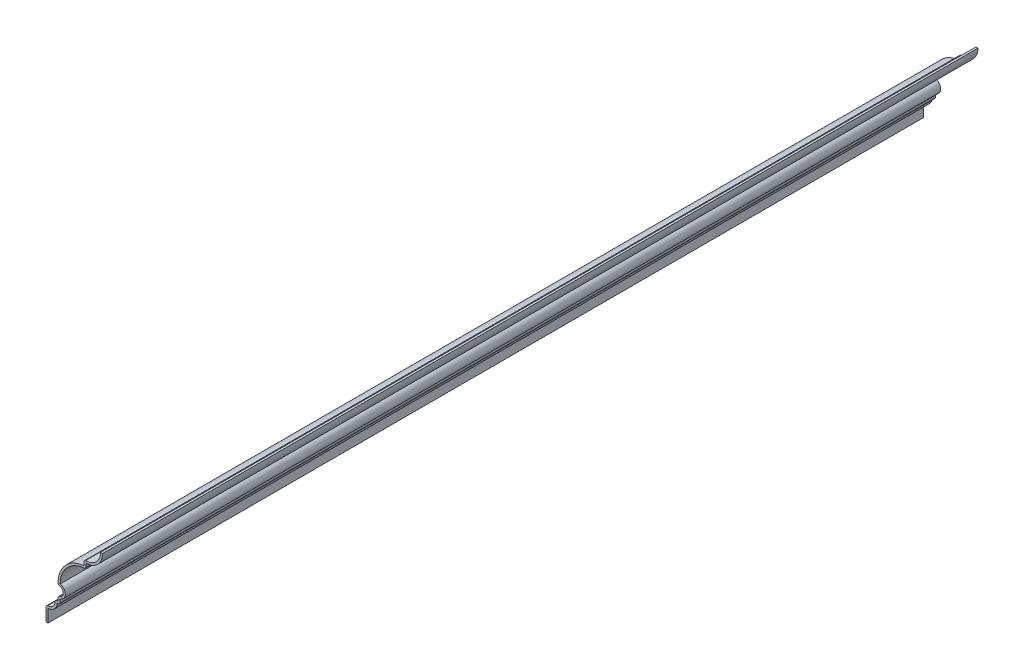
ISO-10303-21;
HEADER;
FILE_DESCRIPTION(('STEP AP214'),'2;1');
FILE_NAME('part.step','',(''),(''),'','','');
FILE_SCHEMA(('AUTOMOTIVE_DESIGN { 1 0 10303 214 1 1 1 1 }'));
ENDSEC;
DATA;
#1=APPLICATION_CONTEXT('core data for automotive mechanical design processes');
#2=APPLICATION_PROTOCOL_DEFINITION('international standard','automotive_design',2000,#1);
#3=PRODUCT_CONTEXT('',#1,'mechanical');
#4=PRODUCT('Part','Part','',(#3));
#5=PRODUCT_RELATED_PRODUCT_CATEGORY('part','',(#4));
#6=PRODUCT_DEFINITION_FORMATION('','',#4);
#7=PRODUCT_DEFINITION_CONTEXT('part definition',#1,'design');
#8=PRODUCT_DEFINITION('design','',#6,#7);
#9=PRODUCT_DEFINITION_SHAPE('','',#8);
#10=(LENGTH_UNIT() NAMED_UNIT(*) SI_UNIT(.MILLI.,.METRE.));
#11=(NAMED_UNIT(*) PLANE_ANGLE_UNIT() SI_UNIT($,.RADIAN.));
#12=(NAMED_UNIT(*) SI_UNIT($,.STERADIAN.) SOLID_ANGLE_UNIT());
#13=UNCERTAINTY_MEASURE_WITH_UNIT(LENGTH_MEASURE(1.E-05),#10,'distance_accuracy_value','');
#14=(GEOMETRIC_REPRESENTATION_CONTEXT(3) GLOBAL_UNCERTAINTY_ASSIGNED_CONTEXT((#13)) GLOBAL_UNIT_ASSIGNED_CONTEXT((#10,
#11,#12)) REPRESENTATION_CONTEXT('',''));
#15=CARTESIAN_POINT('',(0.,0.,0.));
#16=DIRECTION('',(0.,0.,1.));
#17=DIRECTION('',(1.,0.,0.));
#18=AXIS2_PLACEMENT_3D('',#15,#16,#17);
#19=CARTESIAN_POINT('',(-10.31875,53.975,-539.75));
#20=DIRECTION('',(0.,0.,1.));
#21=DIRECTION('',(1.,0.,0.));
#22=AXIS2_PLACEMENT_3D('',#19,#20,#21);
#23=CYLINDRICAL_SURFACE('',#22,10.31875);
#24=CARTESIAN_POINT('',(-10.31875,53.975,0.));
#25=DIRECTION('',(0.,0.,1.));
#26=DIRECTION('',(1.,0.,0.));
#27=AXIS2_PLACEMENT_3D('',#24,#25,#26);
#28=CIRCLE('',#27,10.31875);
#29=CARTESIAN_POINT('',(-10.31875,43.65625,0.));
#30=VERTEX_POINT('',#29);
#31=CARTESIAN_POINT('',(0.,53.975,0.));
#32=VERTEX_POINT('',#31);
#33=EDGE_CURVE('E270',#30,#32,#28,.T.);
#34=ORIENTED_EDGE('',*,*,#33,.F.);
#35=DIRECTION('',(0.,0.,1.));
#36=VECTOR('',#35,1.);
#37=CARTESIAN_POINT('',(-10.31875,43.65625,-539.75));
#38=LINE('',#37,#36);
#39=CARTESIAN_POINT('',(-10.31875,43.65625,-539.75));
#40=VERTEX_POINT('',#39);
#41=EDGE_CURVE('E226',#40,#30,#38,.T.);
#42=ORIENTED_EDGE('',*,*,#41,.F.);
#43=CARTESIAN_POINT('',(-10.31875,53.975,-539.75));
#44=DIRECTION('',(0.,0.,1.));
#45=DIRECTION('',(1.,0.,0.));
#46=AXIS2_PLACEMENT_3D('',#43,#44,#45);
#47=CIRCLE('',#46,10.31875);
#48=CARTESIAN_POINT('',(0.,53.975,-539.75));
#49=VERTEX_POINT('',#48);
#50=EDGE_CURVE('E207',#40,#49,#47,.T.);
#51=ORIENTED_EDGE('',*,*,#50,.T.);
#52=DIRECTION('',(0.,0.,1.));
#53=VECTOR('',#52,1.);
#54=CARTESIAN_POINT('',(0.,53.975,-539.75));
#55=LINE('',#54,#53);
#56=EDGE_CURVE('E214',#49,#32,#55,.T.);
#57=ORIENTED_EDGE('',*,*,#56,.T.);
#58=EDGE_LOOP('',(#34,#42,#51,#57));
#59=FACE_BOUND('',#58,.T.);
#60=ADVANCED_FACE('F35',(#59),#23,.T.);
#61=CARTESIAN_POINT('',(-10.31875,40.48125,-539.75));
#62=DIRECTION('',(1.,0.,0.));
#63=DIRECTION('',(0.,0.,-1.));
#64=AXIS2_PLACEMENT_3D('',#61,#62,#63);
#65=PLANE('',#64);
#66=DIRECTION('',(0.,1.,0.));
#67=VECTOR('',#66,1.);
#68=CARTESIAN_POINT('',(-10.31875,40.48125,0.));
#69=LINE('',#68,#67);
#70=CARTESIAN_POINT('',(-10.31875,41.704148262652,0.));
#71=VERTEX_POINT('',#70);
#72=EDGE_CURVE('E227',#71,#30,#69,.T.);
#73=ORIENTED_EDGE('',*,*,#72,.F.);
#74=DIRECTION('',(0.,0.,1.));
#75=VECTOR('',#74,1.);
#76=CARTESIAN_POINT('',(-10.31875,41.704148262652,-539.75));
#77=LINE('',#76,#75);
#78=CARTESIAN_POINT('',(-10.31875,41.704148262652,-539.75));
#79=VERTEX_POINT('',#78);
#80=EDGE_CURVE('E388',#71,#79,#77,.F.);
#81=ORIENTED_EDGE('',*,*,#80,.T.);
#82=DIRECTION('',(0.,1.,0.));
#83=VECTOR('',#82,1.);
#84=CARTESIAN_POINT('',(-10.31875,40.48125,-539.75));
#85=LINE('',#84,#83);
#86=EDGE_CURVE('E222',#79,#40,#85,.T.);
#87=ORIENTED_EDGE('',*,*,#86,.T.);
#88=ORIENTED_EDGE('',*,*,#41,.T.);
#89=EDGE_LOOP('',(#73,#81,#87,#88));
#90=FACE_BOUND('',#89,.T.);
#91=ADVANCED_FACE('F402',(#90),#65,.T.);
#92=CARTESIAN_POINT('',(-10.31875,24.60625,-539.75));
#93=DIRECTION('',(0.,0.,1.));
#94=DIRECTION('',(1.,0.,0.));
#95=AXIS2_PLACEMENT_3D('',#92,#93,#94);
#96=CYLINDRICAL_SURFACE('',#95,15.875);
#97=CARTESIAN_POINT('',(-10.31875,24.60625,-539.75));
#98=DIRECTION('',(0.,0.,-1.));
#99=DIRECTION('',(-1.,0.,0.));
#100=AXIS2_PLACEMENT_3D('',#97,#98,#99);
#101=CIRCLE('',#100,15.875);
#102=CARTESIAN_POINT('',(-26.19375,24.60625,-539.75));
#103=VERTEX_POINT('',#102);
#104=CARTESIAN_POINT('',(-11.4946759259259,40.4376372802334,-539.75));
#105=VERTEX_POINT('',#104);
#106=EDGE_CURVE('E266',#103,#105,#101,.T.);
#107=ORIENTED_EDGE('',*,*,#106,.T.);
#108=DIRECTION('',(0.,0.,1.));
#109=VECTOR('',#108,1.);
#110=CARTESIAN_POINT('',(-11.4946759259259,40.4376372802334,-539.75));
#111=LINE('',#110,#109);
#112=CARTESIAN_POINT('',(-11.4946759259259,40.4376372802334,0.));
#113=VERTEX_POINT('',#112);
#114=EDGE_CURVE('E385',#105,#113,#111,.T.);
#115=ORIENTED_EDGE('',*,*,#114,.T.);
#116=CARTESIAN_POINT('',(-10.31875,24.60625,0.));
#117=DIRECTION('',(0.,0.,-1.));
#118=DIRECTION('',(-1.,0.,0.));
#119=AXIS2_PLACEMENT_3D('',#116,#117,#118);
#120=CIRCLE('',#119,15.875);
#121=CARTESIAN_POINT('',(-26.19375,24.60625,0.));
#122=VERTEX_POINT('',#121);
#123=EDGE_CURVE('E229',#122,#113,#120,.T.);
#124=ORIENTED_EDGE('',*,*,#123,.F.);
#125=DIRECTION('',(0.,0.,1.));
#126=VECTOR('',#125,1.);
#127=CARTESIAN_POINT('',(-26.19375,24.60625,-539.75));
#128=LINE('',#127,#126);
#129=EDGE_CURVE('E313',#103,#122,#128,.T.);
#130=ORIENTED_EDGE('',*,*,#129,.F.);
#131=EDGE_LOOP('',(#107,#115,#124,#130));
#132=FACE_BOUND('',#131,.T.);
#133=ADVANCED_FACE('F410',(#132),#96,.F.);
#134=CARTESIAN_POINT('',(-27.08671875,20.6375,-539.75));
#135=DIRECTION('',(0.,0.,1.));
#136=DIRECTION('',(1.,0.,0.));
#137=AXIS2_PLACEMENT_3D('',#134,#135,#136);
#138=CYLINDRICAL_SURFACE('',#137,4.06796875);
#139=CARTESIAN_POINT('',(-27.08671875,20.6375,0.));
#140=DIRECTION('',(0.,0.,1.));
#141=DIRECTION('',(1.,0.,0.));
#142=AXIS2_PLACEMENT_3D('',#139,#140,#141);
#143=CIRCLE('',#142,4.06796875);
#144=CARTESIAN_POINT('',(-26.19375,16.66875,0.));
#145=VERTEX_POINT('',#144);
#146=EDGE_CURVE('E306',#145,#122,#143,.T.);
#147=ORIENTED_EDGE('',*,*,#146,.F.);
#148=DIRECTION('',(0.,0.,1.));
#149=VECTOR('',#148,1.);
#150=CARTESIAN_POINT('',(-26.19375,16.66875,-539.75));
#151=LINE('',#150,#149);
#152=CARTESIAN_POINT('',(-26.19375,16.66875,-539.75));
#153=VERTEX_POINT('',#152);
#154=EDGE_CURVE('E315',#153,#145,#151,.T.);
#155=ORIENTED_EDGE('',*,*,#154,.F.);
#156=CARTESIAN_POINT('',(-27.08671875,20.6375,-539.75));
#157=DIRECTION('',(0.,0.,1.));
#158=DIRECTION('',(1.,0.,0.));
#159=AXIS2_PLACEMENT_3D('',#156,#157,#158);
#160=CIRCLE('',#159,4.06796875);
#161=EDGE_CURVE('E263',#153,#103,#160,.T.);
#162=ORIENTED_EDGE('',*,*,#161,.T.);
#163=ORIENTED_EDGE('',*,*,#129,.T.);
#164=EDGE_LOOP('',(#147,#155,#162,#163));
#165=FACE_BOUND('',#164,.T.);
#166=ADVANCED_FACE('F415',(#165),#138,.T.);
#167=CARTESIAN_POINT('',(-26.19375,13.49375,-539.75));
#168=DIRECTION('',(1.,0.,0.));
#169=DIRECTION('',(0.,0.,-1.));
#170=AXIS2_PLACEMENT_3D('',#167,#168,#169);
#171=PLANE('',#170);
#172=DIRECTION('',(0.,1.,0.));
#173=VECTOR('',#172,1.);
#174=CARTESIAN_POINT('',(-26.19375,13.49375,0.));
#175=LINE('',#174,#173);
#176=CARTESIAN_POINT('',(-26.19375,14.76375,0.));
#177=VERTEX_POINT('',#176);
#178=EDGE_CURVE('E304',#177,#145,#175,.T.);
#179=ORIENTED_EDGE('',*,*,#178,.F.);
#180=DIRECTION('',(0.,0.,1.));
#181=VECTOR('',#180,1.);
#182=CARTESIAN_POINT('',(-26.19375,14.76375,-539.75));
#183=LINE('',#182,#181);
#184=CARTESIAN_POINT('',(-26.19375,14.76375,-539.75));
#185=VERTEX_POINT('',#184);
#186=EDGE_CURVE('E373',#177,#185,#183,.F.);
#187=ORIENTED_EDGE('',*,*,#186,.T.);
#188=DIRECTION('',(0.,1.,0.));
#189=VECTOR('',#188,1.);
#190=CARTESIAN_POINT('',(-26.19375,13.49375,-539.75));
#191=LINE('',#190,#189);
#192=EDGE_CURVE('E261',#185,#153,#191,.T.);
#193=ORIENTED_EDGE('',*,*,#192,.T.);
#194=ORIENTED_EDGE('',*,*,#154,.T.);
#195=EDGE_LOOP('',(#179,#187,#193,#194));
#196=FACE_BOUND('',#195,.T.);
#197=ADVANCED_FACE('F651',(#196),#171,.T.);
#198=CARTESIAN_POINT('',(-28.09875,13.49375,-539.75));
#199=DIRECTION('',(0.,-1.,0.));
#200=DIRECTION('',(0.,0.,-1.));
#201=AXIS2_PLACEMENT_3D('',#198,#199,#200);
#202=PLANE('',#201);
#203=DIRECTION('',(1.,0.,0.));
#204=VECTOR('',#203,1.);
#205=CARTESIAN_POINT('',(-28.09875,13.49375,-539.75));
#206=LINE('',#205,#204);
#207=CARTESIAN_POINT('',(-28.09875,13.49375,-539.75));
#208=VERTEX_POINT('',#207);
#209=CARTESIAN_POINT('',(-27.46375,13.49375,-539.75));
#210=VERTEX_POINT('',#209);
#211=EDGE_CURVE('E258',#208,#210,#206,.T.);
#212=ORIENTED_EDGE('',*,*,#211,.T.);
#213=DIRECTION('',(0.,0.,1.));
#214=VECTOR('',#213,1.);
#215=CARTESIAN_POINT('',(-27.46375,13.49375,-539.75));
#216=LINE('',#215,#214);
#217=CARTESIAN_POINT('',(-27.46375,13.49375,0.));
#218=VERTEX_POINT('',#217);
#219=EDGE_CURVE('E370',#210,#218,#216,.T.);
#220=ORIENTED_EDGE('',*,*,#219,.T.);
#221=DIRECTION('',(1.,0.,0.));
#222=VECTOR('',#221,1.);
#223=CARTESIAN_POINT('',(-28.09875,13.49375,0.));
#224=LINE('',#223,#222);
#225=CARTESIAN_POINT('',(-28.09875,13.49375,0.));
#226=VERTEX_POINT('',#225);
#227=EDGE_CURVE('E301',#226,#218,#224,.T.);
#228=ORIENTED_EDGE('',*,*,#227,.F.);
#229=DIRECTION('',(0.,0.,1.));
#230=VECTOR('',#229,1.);
#231=CARTESIAN_POINT('',(-28.09875,13.49375,-539.75));
#232=LINE('',#231,#230);
#233=EDGE_CURVE('E318',#208,#226,#232,.T.);
#234=ORIENTED_EDGE('',*,*,#233,.F.);
#235=EDGE_LOOP('',(#212,#220,#228,#234));
#236=FACE_BOUND('',#235,.T.);
#237=ADVANCED_FACE('F427',(#236),#202,.T.);
#238=CARTESIAN_POINT('',(-33.655,13.49375,-539.75));
#239=DIRECTION('',(0.,0.,1.));
#240=DIRECTION('',(1.,0.,0.));
#241=AXIS2_PLACEMENT_3D('',#238,#239,#240);
#242=CYLINDRICAL_SURFACE('',#241,5.55625);
#243=CARTESIAN_POINT('',(-33.655,13.49375,0.));
#244=DIRECTION('',(0.,0.,1.));
#245=DIRECTION('',(1.,0.,0.));
#246=AXIS2_PLACEMENT_3D('',#243,#244,#245);
#247=CIRCLE('',#246,5.55625);
#248=CARTESIAN_POINT('',(-33.655,7.9375,0.));
#249=VERTEX_POINT('',#248);
#250=EDGE_CURVE('E298',#249,#226,#247,.T.);
#251=ORIENTED_EDGE('',*,*,#250,.F.);
#252=DIRECTION('',(0.,0.,1.));
#253=VECTOR('',#252,1.);
#254=CARTESIAN_POINT('',(-33.655,7.9375,-539.75));
#255=LINE('',#254,#253);
#256=CARTESIAN_POINT('',(-33.655,7.9375,-539.75));
#257=VERTEX_POINT('',#256);
#258=EDGE_CURVE('E320',#257,#249,#255,.T.);
#259=ORIENTED_EDGE('',*,*,#258,.F.);
#260=CARTESIAN_POINT('',(-33.655,13.49375,-539.75));
#261=DIRECTION('',(0.,0.,1.));
#262=DIRECTION('',(1.,0.,0.));
#263=AXIS2_PLACEMENT_3D('',#260,#261,#262);
#264=CIRCLE('',#263,5.55625);
#265=EDGE_CURVE('E255',#257,#208,#264,.T.);
#266=ORIENTED_EDGE('',*,*,#265,.T.);
#267=ORIENTED_EDGE('',*,*,#233,.T.);
#268=EDGE_LOOP('',(#251,#259,#266,#267));
#269=FACE_BOUND('',#268,.T.);
#270=ADVANCED_FACE('F432',(#269),#242,.T.);
#271=CARTESIAN_POINT('',(-33.655,0.,-539.75));
#272=DIRECTION('',(1.,0.,0.));
#273=DIRECTION('',(0.,0.,-1.));
#274=AXIS2_PLACEMENT_3D('',#271,#272,#273);
#275=PLANE('',#274);
#276=DIRECTION('',(0.,1.,0.));
#277=VECTOR('',#276,1.);
#278=CARTESIAN_POINT('',(-33.655,0.,0.));
#279=LINE('',#278,#277);
#280=CARTESIAN_POINT('',(-33.655,0.,0.));
#281=VERTEX_POINT('',#280);
#282=EDGE_CURVE('E295',#281,#249,#279,.T.);
#283=ORIENTED_EDGE('',*,*,#282,.F.);
#284=DIRECTION('',(0.,0.,1.));
#285=VECTOR('',#284,1.);
#286=CARTESIAN_POINT('',(-33.655,0.,-539.75));
#287=LINE('',#286,#285);
#288=CARTESIAN_POINT('',(-33.655,0.,-539.75));
#289=VERTEX_POINT('',#288);
#290=EDGE_CURVE('E322',#289,#281,#287,.T.);
#291=ORIENTED_EDGE('',*,*,#290,.F.);
#292=DIRECTION('',(0.,1.,0.));
#293=VECTOR('',#292,1.);
#294=CARTESIAN_POINT('',(-33.655,0.,-539.75));
#295=LINE('',#294,#293);
#296=EDGE_CURVE('E252',#289,#257,#295,.T.);
#297=ORIENTED_EDGE('',*,*,#296,.T.);
#298=ORIENTED_EDGE('',*,*,#258,.T.);
#299=EDGE_LOOP('',(#283,#291,#297,#298));
#300=FACE_BOUND('',#299,.T.);
#301=ADVANCED_FACE('F436',(#300),#275,.T.);
#302=CARTESIAN_POINT('',(-33.655,0.,-539.75));
#303=DIRECTION('',(0.,1.,0.));
#304=DIRECTION('',(0.,0.,1.));
#305=AXIS2_PLACEMENT_3D('',#302,#303,#304);
#306=PLANE('',#305);
#307=DIRECTION('',(-1.,0.,0.));
#308=VECTOR('',#307,1.);
#309=CARTESIAN_POINT('',(-33.655,0.,0.));
#310=LINE('',#309,#308);
#311=CARTESIAN_POINT('',(-34.925,0.,0.));
#312=VERTEX_POINT('',#311);
#313=EDGE_CURVE('E293',#281,#312,#310,.T.);
#314=ORIENTED_EDGE('',*,*,#313,.T.);
#315=DIRECTION('',(0.,0.,1.));
#316=VECTOR('',#315,1.);
#317=CARTESIAN_POINT('',(-34.925,0.,-539.75));
#318=LINE('',#317,#316);
#319=CARTESIAN_POINT('',(-34.925,0.,-539.75));
#320=VERTEX_POINT('',#319);
#321=EDGE_CURVE('E324',#320,#312,#318,.T.);
#322=ORIENTED_EDGE('',*,*,#321,.F.);
#323=DIRECTION('',(-1.,0.,0.));
#324=VECTOR('',#323,1.);
#325=CARTESIAN_POINT('',(-33.655,0.,-539.75));
#326=LINE('',#325,#324);
#327=EDGE_CURVE('E250',#289,#320,#326,.T.);
#328=ORIENTED_EDGE('',*,*,#327,.F.);
#329=ORIENTED_EDGE('',*,*,#290,.T.);
#330=EDGE_LOOP('',(#314,#322,#328,#329));
#331=FACE_BOUND('',#330,.T.);
#332=ADVANCED_FACE('F440',(#331),#306,.F.);
#333=CARTESIAN_POINT('',(-34.925,0.,-539.75));
#334=DIRECTION('',(1.,0.,0.));
#335=DIRECTION('',(0.,0.,-1.));
#336=AXIS2_PLACEMENT_3D('',#333,#334,#335);
#337=PLANE('',#336);
#338=DIRECTION('',(0.,1.,0.));
#339=VECTOR('',#338,1.);
#340=CARTESIAN_POINT('',(-34.925,0.,0.));
#341=LINE('',#340,#339);
#342=CARTESIAN_POINT('',(-34.925,7.9375,0.));
#343=VERTEX_POINT('',#342);
#344=EDGE_CURVE('E290',#312,#343,#341,.T.);
#345=ORIENTED_EDGE('',*,*,#344,.T.);
#346=DIRECTION('',(0.,0.,1.));
#347=VECTOR('',#346,1.);
#348=CARTESIAN_POINT('',(-34.925,7.9375,-539.75));
#349=LINE('',#348,#347);
#350=CARTESIAN_POINT('',(-34.925,7.9375,-539.75));
#351=VERTEX_POINT('',#350);
#352=EDGE_CURVE('E352',#343,#351,#349,.F.);
#353=ORIENTED_EDGE('',*,*,#352,.T.);
#354=DIRECTION('',(0.,1.,0.));
#355=VECTOR('',#354,1.);
#356=CARTESIAN_POINT('',(-34.925,0.,-539.75));
#357=LINE('',#356,#355);
#358=EDGE_CURVE('E248',#320,#351,#357,.T.);
#359=ORIENTED_EDGE('',*,*,#358,.F.);
#360=ORIENTED_EDGE('',*,*,#321,.T.);
#361=EDGE_LOOP('',(#345,#353,#359,#360));
#362=FACE_BOUND('',#361,.T.);
#363=ADVANCED_FACE('F615',(#362),#337,.F.);
#364=CARTESIAN_POINT('',(-33.655,13.49375,-539.75));
#365=DIRECTION('',(0.,0.,1.));
#366=DIRECTION('',(1.,0.,0.));
#367=AXIS2_PLACEMENT_3D('',#364,#365,#366);
#368=CYLINDRICAL_SURFACE('',#367,4.28625);
#369=CARTESIAN_POINT('',(-33.655,13.49375,-539.75));
#370=DIRECTION('',(0.,0.,1.));
#371=DIRECTION('',(1.,0.,0.));
#372=AXIS2_PLACEMENT_3D('',#369,#370,#371);
#373=CIRCLE('',#372,4.28625);
#374=CARTESIAN_POINT('',(-33.655,9.2075,-539.75));
#375=VERTEX_POINT('',#374);
#376=CARTESIAN_POINT('',(-29.36875,13.49375,-539.75));
#377=VERTEX_POINT('',#376);
#378=EDGE_CURVE('E245',#375,#377,#373,.T.);
#379=ORIENTED_EDGE('',*,*,#378,.F.);
#380=DIRECTION('',(0.,0.,1.));
#381=VECTOR('',#380,1.);
#382=CARTESIAN_POINT('',(-33.655,9.2075,-539.75));
#383=LINE('',#382,#381);
#384=CARTESIAN_POINT('',(-33.655,9.2075,0.));
#385=VERTEX_POINT('',#384);
#386=EDGE_CURVE('E335',#375,#385,#383,.T.);
#387=ORIENTED_EDGE('',*,*,#386,.T.);
#388=CARTESIAN_POINT('',(-33.655,13.49375,0.));
#389=DIRECTION('',(0.,0.,1.));
#390=DIRECTION('',(1.,0.,0.));
#391=AXIS2_PLACEMENT_3D('',#388,#389,#390);
#392=CIRCLE('',#391,4.28625);
#393=CARTESIAN_POINT('',(-29.36875,13.49375,0.));
#394=VERTEX_POINT('',#393);
#395=EDGE_CURVE('E287',#385,#394,#392,.T.);
#396=ORIENTED_EDGE('',*,*,#395,.T.);
#397=DIRECTION('',(0.,0.,1.));
#398=VECTOR('',#397,1.);
#399=CARTESIAN_POINT('',(-29.36875,13.49375,-539.75));
#400=LINE('',#399,#398);
#401=EDGE_CURVE('E312',#394,#377,#400,.F.);
#402=ORIENTED_EDGE('',*,*,#401,.T.);
#403=EDGE_LOOP('',(#379,#387,#396,#402));
#404=FACE_BOUND('',#403,.T.);
#405=ADVANCED_FACE('F450',(#404),#368,.F.);
#406=CARTESIAN_POINT('',(-28.09875,14.76375,-539.75));
#407=DIRECTION('',(0.,-1.,0.));
#408=DIRECTION('',(0.,0.,-1.));
#409=AXIS2_PLACEMENT_3D('',#406,#407,#408);
#410=PLANE('',#409);
#411=DIRECTION('',(1.,0.,0.));
#412=VECTOR('',#411,1.);
#413=CARTESIAN_POINT('',(-28.09875,14.76375,-539.75));
#414=LINE('',#413,#412);
#415=CARTESIAN_POINT('',(-28.09875,14.76375,-539.75));
#416=VERTEX_POINT('',#415);
#417=CARTESIAN_POINT('',(-27.46375,14.76375,-539.75));
#418=VERTEX_POINT('',#417);
#419=EDGE_CURVE('E243',#416,#418,#414,.T.);
#420=ORIENTED_EDGE('',*,*,#419,.F.);
#421=DIRECTION('',(0.,0.,1.));
#422=VECTOR('',#421,1.);
#423=CARTESIAN_POINT('',(-28.09875,14.76375,-539.75));
#424=LINE('',#423,#422);
#425=CARTESIAN_POINT('',(-28.09875,14.76375,0.));
#426=VERTEX_POINT('',#425);
#427=EDGE_CURVE('E367',#416,#426,#424,.T.);
#428=ORIENTED_EDGE('',*,*,#427,.T.);
#429=DIRECTION('',(1.,0.,0.));
#430=VECTOR('',#429,1.);
#431=CARTESIAN_POINT('',(-28.09875,14.76375,0.));
#432=LINE('',#431,#430);
#433=CARTESIAN_POINT('',(-27.46375,14.76375,0.));
#434=VERTEX_POINT('',#433);
#435=EDGE_CURVE('E285',#426,#434,#432,.T.);
#436=ORIENTED_EDGE('',*,*,#435,.T.);
#437=DIRECTION('',(0.,0.,1.));
#438=VECTOR('',#437,1.);
#439=CARTESIAN_POINT('',(-27.46375,14.76375,-539.75));
#440=LINE('',#439,#438);
#441=EDGE_CURVE('E327',#418,#434,#440,.T.);
#442=ORIENTED_EDGE('',*,*,#441,.F.);
#443=EDGE_LOOP('',(#420,#428,#436,#442));
#444=FACE_BOUND('',#443,.T.);
#445=ADVANCED_FACE('F461',(#444),#410,.F.);
#446=CARTESIAN_POINT('',(-27.46375,13.49375,-539.75));
#447=DIRECTION('',(1.,0.,0.));
#448=DIRECTION('',(0.,0.,-1.));
#449=AXIS2_PLACEMENT_3D('',#446,#447,#448);
#450=PLANE('',#449);
#451=DIRECTION('',(0.,1.,0.));
#452=VECTOR('',#451,1.);
#453=CARTESIAN_POINT('',(-27.46375,13.49375,0.));
#454=LINE('',#453,#452);
#455=CARTESIAN_POINT('',(-27.46375,16.66875,0.));
#456=VERTEX_POINT('',#455);
#457=EDGE_CURVE('E282',#434,#456,#454,.T.);
#458=ORIENTED_EDGE('',*,*,#457,.T.);
#459=DIRECTION('',(0.,0.,1.));
#460=VECTOR('',#459,1.);
#461=CARTESIAN_POINT('',(-27.46375,16.66875,-539.75));
#462=LINE('',#461,#460);
#463=CARTESIAN_POINT('',(-27.46375,16.66875,-539.75));
#464=VERTEX_POINT('',#463);
#465=EDGE_CURVE('E380',#456,#464,#462,.F.);
#466=ORIENTED_EDGE('',*,*,#465,.T.);
#467=DIRECTION('',(0.,1.,0.));
#468=VECTOR('',#467,1.);
#469=CARTESIAN_POINT('',(-27.46375,13.49375,-539.75));
#470=LINE('',#469,#468);
#471=EDGE_CURVE('E240',#418,#464,#470,.T.);
#472=ORIENTED_EDGE('',*,*,#471,.F.);
#473=ORIENTED_EDGE('',*,*,#441,.T.);
#474=EDGE_LOOP('',(#458,#466,#472,#473));
#475=FACE_BOUND('',#474,.T.);
#476=ADVANCED_FACE('F593',(#475),#450,.F.);
#477=CARTESIAN_POINT('',(-27.08671875,20.6375,-539.75));
#478=DIRECTION('',(0.,0.,1.));
#479=DIRECTION('',(1.,0.,0.));
#480=AXIS2_PLACEMENT_3D('',#477,#478,#479);
#481=CYLINDRICAL_SURFACE('',#480,2.79796875);
#482=CARTESIAN_POINT('',(-27.08671875,20.6375,-539.75));
#483=DIRECTION('',(0.,0.,1.));
#484=DIRECTION('',(1.,0.,0.));
#485=AXIS2_PLACEMENT_3D('',#482,#483,#484);
#486=CIRCLE('',#485,2.79796875);
#487=CARTESIAN_POINT('',(-26.4725304878049,17.9077743902439,-539.75));
#488=VERTEX_POINT('',#487);
#489=CARTESIAN_POINT('',(-26.4725304878049,23.3672256097561,-539.75));
#490=VERTEX_POINT('',#489);
#491=EDGE_CURVE('E237',#488,#490,#486,.T.);
#492=ORIENTED_EDGE('',*,*,#491,.F.);
#493=DIRECTION('',(0.,0.,1.));
#494=VECTOR('',#493,1.);
#495=CARTESIAN_POINT('',(-26.4725304878049,17.9077743902439,-539.75));
#496=LINE('',#495,#494);
#497=CARTESIAN_POINT('',(-26.4725304878049,17.9077743902439,0.));
#498=VERTEX_POINT('',#497);
#499=EDGE_CURVE('E377',#488,#498,#496,.T.);
#500=ORIENTED_EDGE('',*,*,#499,.T.);
#501=CARTESIAN_POINT('',(-27.08671875,20.6375,0.));
#502=DIRECTION('',(0.,0.,1.));
#503=DIRECTION('',(1.,0.,0.));
#504=AXIS2_PLACEMENT_3D('',#501,#502,#503);
#505=CIRCLE('',#504,2.79796875);
#506=CARTESIAN_POINT('',(-26.4725304878049,23.3672256097561,0.));
#507=VERTEX_POINT('',#506);
#508=EDGE_CURVE('E279',#498,#507,#505,.T.);
#509=ORIENTED_EDGE('',*,*,#508,.T.);
#510=DIRECTION('',(0.,0.,1.));
#511=VECTOR('',#510,1.);
#512=CARTESIAN_POINT('',(-26.4725304878049,23.3672256097561,-539.75));
#513=LINE('',#512,#511);
#514=EDGE_CURVE('E375',#507,#490,#513,.F.);
#515=ORIENTED_EDGE('',*,*,#514,.T.);
#516=EDGE_LOOP('',(#492,#500,#509,#515));
#517=FACE_BOUND('',#516,.T.);
#518=ADVANCED_FACE('F473',(#517),#481,.F.);
#519=CARTESIAN_POINT('',(-10.31875,24.60625,-539.75));
#520=DIRECTION('',(0.,0.,1.));
#521=DIRECTION('',(1.,0.,0.));
#522=AXIS2_PLACEMENT_3D('',#519,#520,#521);
#523=CYLINDRICAL_SURFACE('',#522,17.145);
#524=CARTESIAN_POINT('',(-10.31875,24.60625,-539.75));
#525=DIRECTION('',(0.,0.,1.));
#526=DIRECTION('',(1.,0.,0.));
#527=AXIS2_PLACEMENT_3D('',#524,#525,#526);
#528=CIRCLE('',#527,17.145);
#529=CARTESIAN_POINT('',(-27.46375,24.60625,-539.75));
#530=VERTEX_POINT('',#529);
#531=CARTESIAN_POINT('',(-11.58875,41.704148262652,-539.75));
#532=VERTEX_POINT('',#531);
#533=EDGE_CURVE('E235',#530,#532,#528,.F.);
#534=ORIENTED_EDGE('',*,*,#533,.F.);
#535=DIRECTION('',(0.,0.,1.));
#536=VECTOR('',#535,1.);
#537=CARTESIAN_POINT('',(-27.46375,24.60625,-539.75));
#538=LINE('',#537,#536);
#539=CARTESIAN_POINT('',(-27.46375,24.60625,0.));
#540=VERTEX_POINT('',#539);
#541=EDGE_CURVE('E382',#530,#540,#538,.T.);
#542=ORIENTED_EDGE('',*,*,#541,.T.);
#543=CARTESIAN_POINT('',(-10.31875,24.60625,0.));
#544=DIRECTION('',(0.,0.,1.));
#545=DIRECTION('',(1.,0.,0.));
#546=AXIS2_PLACEMENT_3D('',#543,#544,#545);
#547=CIRCLE('',#546,17.145);
#548=CARTESIAN_POINT('',(-11.58875,41.704148262652,0.));
#549=VERTEX_POINT('',#548);
#550=EDGE_CURVE('E277',#540,#549,#547,.F.);
#551=ORIENTED_EDGE('',*,*,#550,.T.);
#552=DIRECTION('',(0.,0.,1.));
#553=VECTOR('',#552,1.);
#554=CARTESIAN_POINT('',(-11.58875,41.704148262652,-539.75));
#555=LINE('',#554,#553);
#556=EDGE_CURVE('E330',#532,#549,#555,.T.);
#557=ORIENTED_EDGE('',*,*,#556,.F.);
#558=EDGE_LOOP('',(#534,#542,#551,#557));
#559=FACE_BOUND('',#558,.T.);
#560=ADVANCED_FACE('F482',(#559),#523,.T.);
#561=CARTESIAN_POINT('',(-11.58875,40.48125,-539.75));
#562=DIRECTION('',(1.,0.,0.));
#563=DIRECTION('',(0.,0.,-1.));
#564=AXIS2_PLACEMENT_3D('',#561,#562,#563);
#565=PLANE('',#564);
#566=DIRECTION('',(0.,1.,0.));
#567=VECTOR('',#566,1.);
#568=CARTESIAN_POINT('',(-11.58875,40.48125,0.));
#569=LINE('',#568,#567);
#570=CARTESIAN_POINT('',(-11.58875,43.65625,0.));
#571=VERTEX_POINT('',#570);
#572=EDGE_CURVE('E275',#549,#571,#569,.T.);
#573=ORIENTED_EDGE('',*,*,#572,.T.);
#574=DIRECTION('',(0.,0.,1.));
#575=VECTOR('',#574,1.);
#576=CARTESIAN_POINT('',(-11.58875,43.65625,-539.75));
#577=LINE('',#576,#575);
#578=CARTESIAN_POINT('',(-11.58875,43.65625,-539.75));
#579=VERTEX_POINT('',#578);
#580=EDGE_CURVE('E11',#571,#579,#577,.F.);
#581=ORIENTED_EDGE('',*,*,#580,.T.);
#582=DIRECTION('',(0.,1.,0.));
#583=VECTOR('',#582,1.);
#584=CARTESIAN_POINT('',(-11.58875,40.48125,-539.75));
#585=LINE('',#584,#583);
#586=EDGE_CURVE('E233',#532,#579,#585,.T.);
#587=ORIENTED_EDGE('',*,*,#586,.F.);
#588=ORIENTED_EDGE('',*,*,#556,.T.);
#589=EDGE_LOOP('',(#573,#581,#587,#588));
#590=FACE_BOUND('',#589,.T.);
#591=ADVANCED_FACE('F572',(#590),#565,.F.);
#592=CARTESIAN_POINT('',(-10.31875,53.975,-539.75));
#593=DIRECTION('',(0.,0.,1.));
#594=DIRECTION('',(1.,0.,0.));
#595=AXIS2_PLACEMENT_3D('',#592,#593,#594);
#596=CYLINDRICAL_SURFACE('',#595,9.04875);
#597=CARTESIAN_POINT('',(-10.31875,53.975,-539.75));
#598=DIRECTION('',(0.,0.,1.));
#599=DIRECTION('',(1.,0.,0.));
#600=AXIS2_PLACEMENT_3D('',#597,#598,#599);
#601=CIRCLE('',#600,9.04875);
#602=CARTESIAN_POINT('',(-10.31875,44.92625,-539.75));
#603=VERTEX_POINT('',#602);
#604=CARTESIAN_POINT('',(-1.27,53.975,-539.75));
#605=VERTEX_POINT('',#604);
#606=EDGE_CURVE('E208',#603,#605,#601,.T.);
#607=ORIENTED_EDGE('',*,*,#606,.F.);
#608=DIRECTION('',(0.,0.,1.));
#609=VECTOR('',#608,1.);
#610=CARTESIAN_POINT('',(-10.31875,44.92625,-539.75));
#611=LINE('',#610,#609);
#612=CARTESIAN_POINT('',(-10.31875,44.92625,0.));
#613=VERTEX_POINT('',#612);
#614=EDGE_CURVE('E43',#603,#613,#611,.T.);
#615=ORIENTED_EDGE('',*,*,#614,.T.);
#616=CARTESIAN_POINT('',(-10.31875,53.975,0.));
#617=DIRECTION('',(0.,0.,1.));
#618=DIRECTION('',(1.,0.,0.));
#619=AXIS2_PLACEMENT_3D('',#616,#617,#618);
#620=CIRCLE('',#619,9.04875);
#621=CARTESIAN_POINT('',(-1.27,53.975,0.));
#622=VERTEX_POINT('',#621);
#623=EDGE_CURVE('E273',#613,#622,#620,.T.);
#624=ORIENTED_EDGE('',*,*,#623,.T.);
#625=DIRECTION('',(0.,0.,1.));
#626=VECTOR('',#625,1.);
#627=CARTESIAN_POINT('',(-1.27,53.975,-539.75));
#628=LINE('',#627,#626);
#629=EDGE_CURVE('E221',#605,#622,#628,.T.);
#630=ORIENTED_EDGE('',*,*,#629,.F.);
#631=EDGE_LOOP('',(#607,#615,#624,#630));
#632=FACE_BOUND('',#631,.T.);
#633=ADVANCED_FACE('F393',(#632),#596,.F.);
#634=CARTESIAN_POINT('',(-1.27,53.975,-539.75));
#635=DIRECTION('',(0.,-1.,0.));
#636=DIRECTION('',(0.,0.,-1.));
#637=AXIS2_PLACEMENT_3D('',#634,#635,#636);
#638=PLANE('',#637);
#639=DIRECTION('',(1.,0.,0.));
#640=VECTOR('',#639,1.);
#641=CARTESIAN_POINT('',(-1.27,53.975,0.));
#642=LINE('',#641,#640);
#643=EDGE_CURVE('E217',#622,#32,#642,.T.);
#644=ORIENTED_EDGE('',*,*,#643,.T.);
#645=ORIENTED_EDGE('',*,*,#56,.F.);
#646=DIRECTION('',(1.,0.,0.));
#647=VECTOR('',#646,1.);
#648=CARTESIAN_POINT('',(-1.27,53.975,-539.75));
#649=LINE('',#648,#647);
#650=EDGE_CURVE('E201',#605,#49,#649,.T.);
#651=ORIENTED_EDGE('',*,*,#650,.F.);
#652=ORIENTED_EDGE('',*,*,#629,.T.);
#653=EDGE_LOOP('',(#644,#645,#651,#652));
#654=FACE_BOUND('',#653,.T.);
#655=ADVANCED_FACE('F215',(#654),#638,.F.);
#656=CARTESIAN_POINT('',(-10.31875,53.975,-539.75));
#657=DIRECTION('',(0.,0.,1.));
#658=DIRECTION('',(1.,0.,0.));
#659=AXIS2_PLACEMENT_3D('',#656,#657,#658);
#660=PLANE('',#659);
#661=ORIENTED_EDGE('',*,*,#358,.T.);
#662=CARTESIAN_POINT('',(-33.655,7.9375,-539.75));
#663=DIRECTION('',(0.,0.,1.));
#664=DIRECTION('',(1.,0.,0.));
#665=AXIS2_PLACEMENT_3D('',#662,#663,#664);
#666=CIRCLE('',#665,1.27);
#667=EDGE_CURVE('E365',#351,#375,#666,.F.);
#668=ORIENTED_EDGE('',*,*,#667,.T.);
#669=ORIENTED_EDGE('',*,*,#378,.T.);
#670=CARTESIAN_POINT('',(-28.09875,13.49375,-539.75));
#671=DIRECTION('',(0.,0.,1.));
#672=DIRECTION('',(1.,0.,0.));
#673=AXIS2_PLACEMENT_3D('',#670,#671,#672);
#674=CIRCLE('',#673,1.27);
#675=EDGE_CURVE('E363',#377,#416,#674,.F.);
#676=ORIENTED_EDGE('',*,*,#675,.T.);
#677=ORIENTED_EDGE('',*,*,#419,.T.);
#678=ORIENTED_EDGE('',*,*,#471,.T.);
#679=CARTESIAN_POINT('',(-26.19375,16.66875,-539.75));
#680=DIRECTION('',(0.,0.,1.));
#681=DIRECTION('',(1.,0.,0.));
#682=AXIS2_PLACEMENT_3D('',#679,#680,#681);
#683=CIRCLE('',#682,1.27);
#684=EDGE_CURVE('E359',#464,#488,#683,.F.);
#685=ORIENTED_EDGE('',*,*,#684,.T.);
#686=ORIENTED_EDGE('',*,*,#491,.T.);
#687=CARTESIAN_POINT('',(-26.19375,24.60625,-539.75));
#688=DIRECTION('',(0.,0.,1.));
#689=DIRECTION('',(1.,0.,0.));
#690=AXIS2_PLACEMENT_3D('',#687,#688,#689);
#691=CIRCLE('',#690,1.27);
#692=EDGE_CURVE('E357',#490,#530,#691,.F.);
#693=ORIENTED_EDGE('',*,*,#692,.T.);
#694=ORIENTED_EDGE('',*,*,#533,.T.);
#695=ORIENTED_EDGE('',*,*,#586,.T.);
#696=CARTESIAN_POINT('',(-10.31875,43.65625,-539.75));
#697=DIRECTION('',(0.,0.,1.));
#698=DIRECTION('',(1.,0.,0.));
#699=AXIS2_PLACEMENT_3D('',#696,#697,#698);
#700=CIRCLE('',#699,1.27);
#701=EDGE_CURVE('E50',#579,#603,#700,.F.);
#702=ORIENTED_EDGE('',*,*,#701,.T.);
#703=ORIENTED_EDGE('',*,*,#606,.T.);
#704=ORIENTED_EDGE('',*,*,#650,.T.);
#705=ORIENTED_EDGE('',*,*,#50,.F.);
#706=ORIENTED_EDGE('',*,*,#86,.F.);
#707=CARTESIAN_POINT('',(-11.58875,41.704148262652,-539.75));
#708=DIRECTION('',(0.,0.,1.));
#709=DIRECTION('',(1.,0.,0.));
#710=AXIS2_PLACEMENT_3D('',#707,#708,#709);
#711=CIRCLE('',#710,1.27);
#712=EDGE_CURVE('E355',#79,#105,#711,.F.);
#713=ORIENTED_EDGE('',*,*,#712,.T.);
#714=ORIENTED_EDGE('',*,*,#106,.F.);
#715=ORIENTED_EDGE('',*,*,#161,.F.);
#716=ORIENTED_EDGE('',*,*,#192,.F.);
#717=CARTESIAN_POINT('',(-27.46375,14.76375,-539.75));
#718=DIRECTION('',(0.,0.,1.));
#719=DIRECTION('',(1.,0.,0.));
#720=AXIS2_PLACEMENT_3D('',#717,#718,#719);
#721=CIRCLE('',#720,1.27);
#722=EDGE_CURVE('E361',#185,#210,#721,.F.);
#723=ORIENTED_EDGE('',*,*,#722,.T.);
#724=ORIENTED_EDGE('',*,*,#211,.F.);
#725=ORIENTED_EDGE('',*,*,#265,.F.);
#726=ORIENTED_EDGE('',*,*,#296,.F.);
#727=ORIENTED_EDGE('',*,*,#327,.T.);
#728=EDGE_LOOP('',(#661,#668,#669,#676,#677,#678,#685,#686,#693,#694,#695,#702,#703,#704,#705,
#706,#713,#714,#715,#716,#723,#724,#725,#726,#727));
#729=FACE_BOUND('',#728,.T.);
#730=ADVANCED_FACE('F204',(#729),#660,.F.);
#731=CARTESIAN_POINT('',(-10.31875,53.975,0.));
#732=DIRECTION('',(0.,0.,1.));
#733=DIRECTION('',(1.,0.,0.));
#734=AXIS2_PLACEMENT_3D('',#731,#732,#733);
#735=PLANE('',#734);
#736=ORIENTED_EDGE('',*,*,#395,.F.);
#737=CARTESIAN_POINT('',(-33.655,7.9375,0.));
#738=DIRECTION('',(0.,0.,1.));
#739=DIRECTION('',(1.,0.,0.));
#740=AXIS2_PLACEMENT_3D('',#737,#738,#739);
#741=CIRCLE('',#740,1.27);
#742=EDGE_CURVE('E350',#385,#343,#741,.T.);
#743=ORIENTED_EDGE('',*,*,#742,.T.);
#744=ORIENTED_EDGE('',*,*,#344,.F.);
#745=ORIENTED_EDGE('',*,*,#313,.F.);
#746=ORIENTED_EDGE('',*,*,#282,.T.);
#747=ORIENTED_EDGE('',*,*,#250,.T.);
#748=ORIENTED_EDGE('',*,*,#227,.T.);
#749=CARTESIAN_POINT('',(-27.46375,14.76375,0.));
#750=DIRECTION('',(0.,0.,1.));
#751=DIRECTION('',(1.,0.,0.));
#752=AXIS2_PLACEMENT_3D('',#749,#750,#751);
#753=CIRCLE('',#752,1.27);
#754=EDGE_CURVE('E346',#218,#177,#753,.T.);
#755=ORIENTED_EDGE('',*,*,#754,.T.);
#756=ORIENTED_EDGE('',*,*,#178,.T.);
#757=ORIENTED_EDGE('',*,*,#146,.T.);
#758=ORIENTED_EDGE('',*,*,#123,.T.);
#759=CARTESIAN_POINT('',(-11.58875,41.704148262652,0.));
#760=DIRECTION('',(0.,0.,1.));
#761=DIRECTION('',(1.,0.,0.));
#762=AXIS2_PLACEMENT_3D('',#759,#760,#761);
#763=CIRCLE('',#762,1.27);
#764=EDGE_CURVE('E340',#113,#71,#763,.T.);
#765=ORIENTED_EDGE('',*,*,#764,.T.);
#766=ORIENTED_EDGE('',*,*,#72,.T.);
#767=ORIENTED_EDGE('',*,*,#33,.T.);
#768=ORIENTED_EDGE('',*,*,#643,.F.);
#769=ORIENTED_EDGE('',*,*,#623,.F.);
#770=CARTESIAN_POINT('',(-10.31875,43.65625,0.));
#771=DIRECTION('',(0.,0.,1.));
#772=DIRECTION('',(1.,0.,0.));
#773=AXIS2_PLACEMENT_3D('',#770,#771,#772);
#774=CIRCLE('',#773,1.27);
#775=EDGE_CURVE('E338',#613,#571,#774,.T.);
#776=ORIENTED_EDGE('',*,*,#775,.T.);
#777=ORIENTED_EDGE('',*,*,#572,.F.);
#778=ORIENTED_EDGE('',*,*,#550,.F.);
#779=CARTESIAN_POINT('',(-26.19375,24.60625,0.));
#780=DIRECTION('',(0.,0.,1.));
#781=DIRECTION('',(1.,0.,0.));
#782=AXIS2_PLACEMENT_3D('',#779,#780,#781);
#783=CIRCLE('',#782,1.27);
#784=EDGE_CURVE('E342',#540,#507,#783,.T.);
#785=ORIENTED_EDGE('',*,*,#784,.T.);
#786=ORIENTED_EDGE('',*,*,#508,.F.);
#787=CARTESIAN_POINT('',(-26.19375,16.66875,0.));
#788=DIRECTION('',(0.,0.,1.));
#789=DIRECTION('',(1.,0.,0.));
#790=AXIS2_PLACEMENT_3D('',#787,#788,#789);
#791=CIRCLE('',#790,1.27);
#792=EDGE_CURVE('E344',#498,#456,#791,.T.);
#793=ORIENTED_EDGE('',*,*,#792,.T.);
#794=ORIENTED_EDGE('',*,*,#457,.F.);
#795=ORIENTED_EDGE('',*,*,#435,.F.);
#796=CARTESIAN_POINT('',(-28.09875,13.49375,0.));
#797=DIRECTION('',(0.,0.,1.));
#798=DIRECTION('',(1.,0.,0.));
#799=AXIS2_PLACEMENT_3D('',#796,#797,#798);
#800=CIRCLE('',#799,1.27);
#801=EDGE_CURVE('E348',#426,#394,#800,.T.);
#802=ORIENTED_EDGE('',*,*,#801,.T.);
#803=EDGE_LOOP('',(#736,#743,#744,#745,#746,#747,#748,#755,#756,#757,#758,#765,#766,#767,#768,
#769,#776,#777,#778,#785,#786,#793,#794,#795,#802));
#804=FACE_BOUND('',#803,.T.);
#805=ADVANCED_FACE('F397',(#804),#735,.T.);
#806=CARTESIAN_POINT('',(-33.655,7.9375,-539.75));
#807=DIRECTION('',(0.,0.,1.));
#808=DIRECTION('',(1.,0.,0.));
#809=AXIS2_PLACEMENT_3D('',#806,#807,#808);
#810=CYLINDRICAL_SURFACE('',#809,1.27);
#811=ORIENTED_EDGE('',*,*,#667,.F.);
#812=ORIENTED_EDGE('',*,*,#352,.F.);
#813=ORIENTED_EDGE('',*,*,#742,.F.);
#814=ORIENTED_EDGE('',*,*,#386,.F.);
#815=EDGE_LOOP('',(#811,#812,#813,#814));
#816=FACE_BOUND('',#815,.T.);
#817=ADVANCED_FACE('F448',(#816),#810,.T.);
#818=CARTESIAN_POINT('',(-28.09875,13.49375,-539.75));
#819=DIRECTION('',(0.,0.,1.));
#820=DIRECTION('',(1.,0.,0.));
#821=AXIS2_PLACEMENT_3D('',#818,#819,#820);
#822=CYLINDRICAL_SURFACE('',#821,1.27);
#823=ORIENTED_EDGE('',*,*,#675,.F.);
#824=ORIENTED_EDGE('',*,*,#401,.F.);
#825=ORIENTED_EDGE('',*,*,#801,.F.);
#826=ORIENTED_EDGE('',*,*,#427,.F.);
#827=EDGE_LOOP('',(#823,#824,#825,#826));
#828=FACE_BOUND('',#827,.T.);
#829=ADVANCED_FACE('F458',(#828),#822,.T.);
#830=CARTESIAN_POINT('',(-27.46375,14.76375,-539.75));
#831=DIRECTION('',(0.,0.,1.));
#832=DIRECTION('',(1.,0.,0.));
#833=AXIS2_PLACEMENT_3D('',#830,#831,#832);
#834=CYLINDRICAL_SURFACE('',#833,1.27);
#835=ORIENTED_EDGE('',*,*,#722,.F.);
#836=ORIENTED_EDGE('',*,*,#186,.F.);
#837=ORIENTED_EDGE('',*,*,#754,.F.);
#838=ORIENTED_EDGE('',*,*,#219,.F.);
#839=EDGE_LOOP('',(#835,#836,#837,#838));
#840=FACE_BOUND('',#839,.T.);
#841=ADVANCED_FACE('F424',(#840),#834,.T.);
#842=CARTESIAN_POINT('',(-26.19375,16.66875,-539.75));
#843=DIRECTION('',(0.,0.,1.));
#844=DIRECTION('',(1.,0.,0.));
#845=AXIS2_PLACEMENT_3D('',#842,#843,#844);
#846=CYLINDRICAL_SURFACE('',#845,1.27);
#847=ORIENTED_EDGE('',*,*,#684,.F.);
#848=ORIENTED_EDGE('',*,*,#465,.F.);
#849=ORIENTED_EDGE('',*,*,#792,.F.);
#850=ORIENTED_EDGE('',*,*,#499,.F.);
#851=EDGE_LOOP('',(#847,#848,#849,#850));
#852=FACE_BOUND('',#851,.T.);
#853=ADVANCED_FACE('F470',(#852),#846,.T.);
#854=CARTESIAN_POINT('',(-26.19375,24.60625,-539.75));
#855=DIRECTION('',(0.,0.,-1.));
#856=DIRECTION('',(-1.,0.,0.));
#857=AXIS2_PLACEMENT_3D('',#854,#855,#856);
#858=CYLINDRICAL_SURFACE('',#857,1.27);
#859=ORIENTED_EDGE('',*,*,#692,.F.);
#860=ORIENTED_EDGE('',*,*,#514,.F.);
#861=ORIENTED_EDGE('',*,*,#784,.F.);
#862=ORIENTED_EDGE('',*,*,#541,.F.);
#863=EDGE_LOOP('',(#859,#860,#861,#862));
#864=FACE_BOUND('',#863,.T.);
#865=ADVANCED_FACE('F479',(#864),#858,.T.);
#866=CARTESIAN_POINT('',(-11.58875,41.704148262652,-539.75));
#867=DIRECTION('',(0.,0.,1.));
#868=DIRECTION('',(1.,0.,0.));
#869=AXIS2_PLACEMENT_3D('',#866,#867,#868);
#870=CYLINDRICAL_SURFACE('',#869,1.27);
#871=ORIENTED_EDGE('',*,*,#712,.F.);
#872=ORIENTED_EDGE('',*,*,#80,.F.);
#873=ORIENTED_EDGE('',*,*,#764,.F.);
#874=ORIENTED_EDGE('',*,*,#114,.F.);
#875=EDGE_LOOP('',(#871,#872,#873,#874));
#876=FACE_BOUND('',#875,.T.);
#877=ADVANCED_FACE('F407',(#876),#870,.T.);
#878=CARTESIAN_POINT('',(-10.31875,43.65625,-539.75));
#879=DIRECTION('',(0.,0.,1.));
#880=DIRECTION('',(1.,0.,0.));
#881=AXIS2_PLACEMENT_3D('',#878,#879,#880);
#882=CYLINDRICAL_SURFACE('',#881,1.27);
#883=ORIENTED_EDGE('',*,*,#701,.F.);
#884=ORIENTED_EDGE('',*,*,#580,.F.);
#885=ORIENTED_EDGE('',*,*,#775,.F.);
#886=ORIENTED_EDGE('',*,*,#614,.F.);
#887=EDGE_LOOP('',(#883,#884,#885,#886));
#888=FACE_BOUND('',#887,.T.);
#889=ADVANCED_FACE('F37',(#888),#882,.T.);
#890=CLOSED_SHELL('',(#60,#91,#133,#166,#197,#237,#270,#301,#332,#363,#405,#445,#476,#518,#560,
#591,#633,#655,#730,#805,#817,#829,#841,#853,#865,#877,#889));
#891=MANIFOLD_SOLID_BREP('B2',#890);
#892=ADVANCED_BREP_SHAPE_REPRESENTATION('',(#18,#891),#14);
#893=SHAPE_DEFINITION_REPRESENTATION(#9,#892);
ENDSEC;
END-ISO-10303-21;
